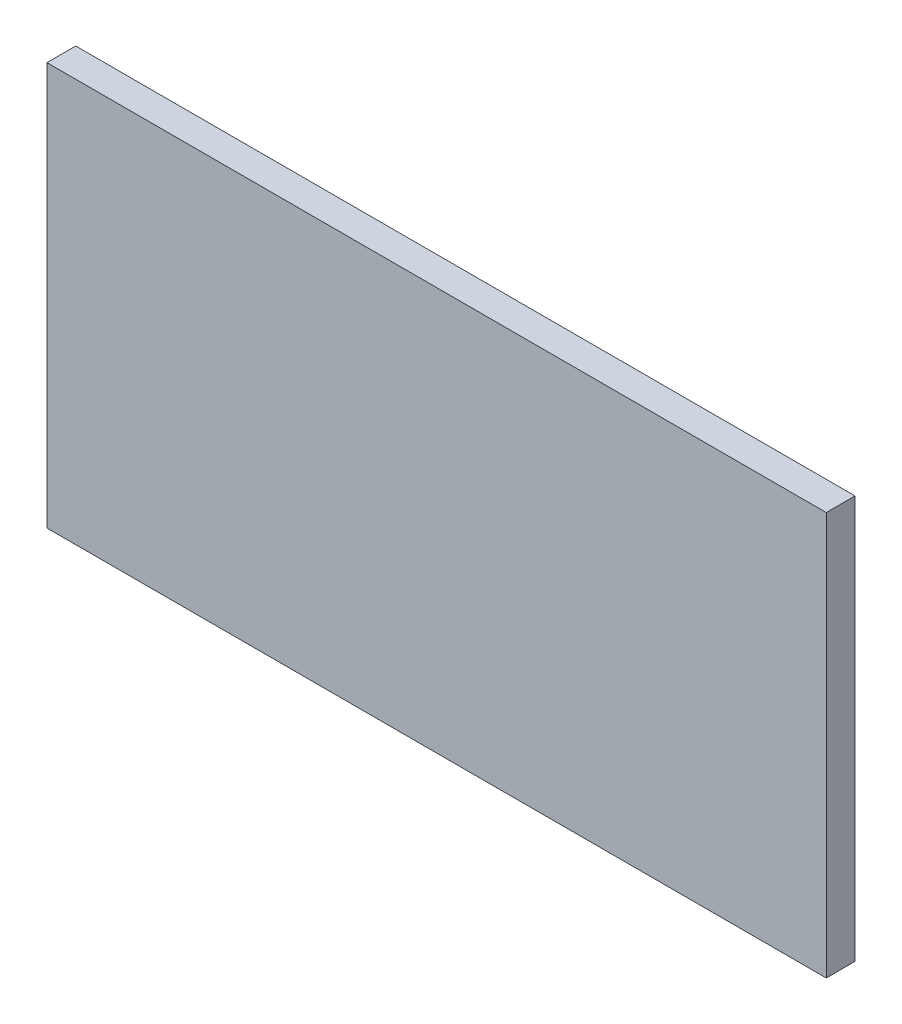
ISO-10303-21;
HEADER;
FILE_DESCRIPTION(('STEP AP214'),'2;1');
FILE_NAME('part.step','',(''),(''),'','','');
FILE_SCHEMA(('AUTOMOTIVE_DESIGN { 1 0 10303 214 1 1 1 1 }'));
ENDSEC;
DATA;
#1=APPLICATION_CONTEXT('core data for automotive mechanical design processes');
#2=APPLICATION_PROTOCOL_DEFINITION('international standard','automotive_design',2000,#1);
#3=PRODUCT_CONTEXT('',#1,'mechanical');
#4=PRODUCT('Part','Part','',(#3));
#5=PRODUCT_RELATED_PRODUCT_CATEGORY('part','',(#4));
#6=PRODUCT_DEFINITION_FORMATION('','',#4);
#7=PRODUCT_DEFINITION_CONTEXT('part definition',#1,'design');
#8=PRODUCT_DEFINITION('design','',#6,#7);
#9=PRODUCT_DEFINITION_SHAPE('','',#8);
#10=(LENGTH_UNIT() NAMED_UNIT(*) SI_UNIT(.MILLI.,.METRE.));
#11=(NAMED_UNIT(*) PLANE_ANGLE_UNIT() SI_UNIT($,.RADIAN.));
#12=(NAMED_UNIT(*) SI_UNIT($,.STERADIAN.) SOLID_ANGLE_UNIT());
#13=UNCERTAINTY_MEASURE_WITH_UNIT(LENGTH_MEASURE(1.E-05),#10,'distance_accuracy_value','');
#14=(GEOMETRIC_REPRESENTATION_CONTEXT(3) GLOBAL_UNCERTAINTY_ASSIGNED_CONTEXT((#13)) GLOBAL_UNIT_ASSIGNED_CONTEXT((#10,
#11,#12)) REPRESENTATION_CONTEXT('',''));
#15=CARTESIAN_POINT('',(0.,0.,0.));
#16=DIRECTION('',(0.,0.,1.));
#17=DIRECTION('',(1.,0.,0.));
#18=AXIS2_PLACEMENT_3D('',#15,#16,#17);
#19=CARTESIAN_POINT('',(0.,0.,0.));
#20=DIRECTION('',(0.,0.,-1.));
#21=DIRECTION('',(-1.,0.,0.));
#22=AXIS2_PLACEMENT_3D('',#19,#20,#21);
#23=PLANE('',#22);
#24=CARTESIAN_POINT('',(18.925,5.47,0.));
#25=DIRECTION('',(0.,0.,-1.));
#26=DIRECTION('',(-1.,0.,0.));
#27=AXIS2_PLACEMENT_3D('',#24,#25,#26);
#28=CIRCLE('',#27,0.650000000000001);
#29=CARTESIAN_POINT('',(18.275,5.47,0.));
#30=VERTEX_POINT('',#29);
#31=EDGE_CURVE('E230',#30,#30,#28,.T.);
#32=ORIENTED_EDGE('',*,*,#31,.F.);
#33=EDGE_LOOP('',(#32));
#34=FACE_BOUND('',#33,.T.);
#35=CARTESIAN_POINT('',(20.675,5.46999999999999,0.));
#36=DIRECTION('',(0.,0.,-1.));
#37=DIRECTION('',(-1.,0.,0.));
#38=AXIS2_PLACEMENT_3D('',#35,#36,#37);
#39=CIRCLE('',#38,0.650000000000001);
#40=CARTESIAN_POINT('',(20.025,5.46999999999999,0.));
#41=VERTEX_POINT('',#40);
#42=EDGE_CURVE('E218',#41,#41,#39,.T.);
#43=ORIENTED_EDGE('',*,*,#42,.F.);
#44=EDGE_LOOP('',(#43));
#45=FACE_BOUND('',#44,.T.);
#46=CARTESIAN_POINT('',(18.925,3.72,0.));
#47=DIRECTION('',(0.,0.,-1.));
#48=DIRECTION('',(-1.,0.,0.));
#49=AXIS2_PLACEMENT_3D('',#46,#47,#48);
#50=CIRCLE('',#49,0.650000000000001);
#51=CARTESIAN_POINT('',(18.275,3.72,0.));
#52=VERTEX_POINT('',#51);
#53=EDGE_CURVE('E206',#52,#52,#50,.T.);
#54=ORIENTED_EDGE('',*,*,#53,.F.);
#55=EDGE_LOOP('',(#54));
#56=FACE_BOUND('',#55,.T.);
#57=DIRECTION('',(0.,1.,0.));
#58=VECTOR('',#57,1.);
#59=CARTESIAN_POINT('',(0.,0.,0.));
#60=LINE('',#59,#58);
#61=CARTESIAN_POINT('',(0.,0.,0.));
#62=VERTEX_POINT('',#61);
#63=CARTESIAN_POINT('',(0.,21.,0.));
#64=VERTEX_POINT('',#63);
#65=EDGE_CURVE('E117',#62,#64,#60,.T.);
#66=ORIENTED_EDGE('',*,*,#65,.T.);
#67=DIRECTION('',(1.,0.,0.));
#68=VECTOR('',#67,1.);
#69=CARTESIAN_POINT('',(0.,21.,0.));
#70=LINE('',#69,#68);
#71=CARTESIAN_POINT('',(40.6,21.,0.));
#72=VERTEX_POINT('',#71);
#73=EDGE_CURVE('E156',#64,#72,#70,.T.);
#74=ORIENTED_EDGE('',*,*,#73,.T.);
#75=DIRECTION('',(0.,1.,0.));
#76=VECTOR('',#75,1.);
#77=CARTESIAN_POINT('',(40.6,0.,0.));
#78=LINE('',#77,#76);
#79=CARTESIAN_POINT('',(40.6,0.,0.));
#80=VERTEX_POINT('',#79);
#81=EDGE_CURVE('E159',#80,#72,#78,.T.);
#82=ORIENTED_EDGE('',*,*,#81,.F.);
#83=DIRECTION('',(1.,0.,0.));
#84=VECTOR('',#83,1.);
#85=CARTESIAN_POINT('',(0.,0.,0.));
#86=LINE('',#85,#84);
#87=EDGE_CURVE('E146',#62,#80,#86,.T.);
#88=ORIENTED_EDGE('',*,*,#87,.F.);
#89=EDGE_LOOP('',(#66,#74,#82,#88));
#90=FACE_BOUND('',#89,.T.);
#91=DIRECTION('',(1.,0.,0.));
#92=VECTOR('',#91,1.);
#93=CARTESIAN_POINT('',(6.5,14.81,0.));
#94=LINE('',#93,#92);
#95=CARTESIAN_POINT('',(6.5,14.81,0.));
#96=VERTEX_POINT('',#95);
#97=CARTESIAN_POINT('',(10.26,14.81,0.));
#98=VERTEX_POINT('',#97);
#99=EDGE_CURVE('E115',#96,#98,#94,.T.);
#100=ORIENTED_EDGE('',*,*,#99,.F.);
#101=DIRECTION('',(0.,1.,0.));
#102=VECTOR('',#101,1.);
#103=CARTESIAN_POINT('',(6.5,11.81,0.));
#104=LINE('',#103,#102);
#105=CARTESIAN_POINT('',(6.5,11.81,0.));
#106=VERTEX_POINT('',#105);
#107=EDGE_CURVE('E121',#106,#96,#104,.T.);
#108=ORIENTED_EDGE('',*,*,#107,.F.);
#109=DIRECTION('',(-1.,0.,0.));
#110=VECTOR('',#109,1.);
#111=CARTESIAN_POINT('',(6.5,11.81,0.));
#112=LINE('',#111,#110);
#113=CARTESIAN_POINT('',(10.26,11.81,0.));
#114=VERTEX_POINT('',#113);
#115=EDGE_CURVE('E133',#114,#106,#112,.T.);
#116=ORIENTED_EDGE('',*,*,#115,.F.);
#117=DIRECTION('',(0.,-1.,0.));
#118=VECTOR('',#117,1.);
#119=CARTESIAN_POINT('',(10.26,11.81,0.));
#120=LINE('',#119,#118);
#121=EDGE_CURVE('E131',#98,#114,#120,.T.);
#122=ORIENTED_EDGE('',*,*,#121,.F.);
#123=EDGE_LOOP('',(#100,#108,#116,#122));
#124=FACE_BOUND('',#123,.T.);
#125=CARTESIAN_POINT('',(20.675,3.71999999999999,0.));
#126=DIRECTION('',(0.,0.,-1.));
#127=DIRECTION('',(-1.,0.,0.));
#128=AXIS2_PLACEMENT_3D('',#125,#126,#127);
#129=CIRCLE('',#128,0.650000000000001);
#130=CARTESIAN_POINT('',(20.025,3.71999999999999,0.));
#131=VERTEX_POINT('',#130);
#132=EDGE_CURVE('E212',#131,#131,#129,.T.);
#133=ORIENTED_EDGE('',*,*,#132,.F.);
#134=EDGE_LOOP('',(#133));
#135=FACE_BOUND('',#134,.T.);
#136=CARTESIAN_POINT('',(20.675,7.21999999999999,0.));
#137=DIRECTION('',(0.,0.,-1.));
#138=DIRECTION('',(-1.,0.,0.));
#139=AXIS2_PLACEMENT_3D('',#136,#137,#138);
#140=CIRCLE('',#139,0.650000000000001);
#141=CARTESIAN_POINT('',(20.025,7.21999999999999,0.));
#142=VERTEX_POINT('',#141);
#143=EDGE_CURVE('E224',#142,#142,#140,.T.);
#144=ORIENTED_EDGE('',*,*,#143,.F.);
#145=EDGE_LOOP('',(#144));
#146=FACE_BOUND('',#145,.T.);
#147=CARTESIAN_POINT('',(18.925,7.22,0.));
#148=DIRECTION('',(0.,0.,-1.));
#149=DIRECTION('',(-1.,0.,0.));
#150=AXIS2_PLACEMENT_3D('',#147,#148,#149);
#151=CIRCLE('',#150,0.650000000000001);
#152=CARTESIAN_POINT('',(18.275,7.22,0.));
#153=VERTEX_POINT('',#152);
#154=EDGE_CURVE('E236',#153,#153,#151,.T.);
#155=ORIENTED_EDGE('',*,*,#154,.F.);
#156=EDGE_LOOP('',(#155));
#157=FACE_BOUND('',#156,.T.);
#158=ADVANCED_FACE('F35',(#34,#45,#56,#90,#124,#135,#146,#157),#23,.T.);
#159=CARTESIAN_POINT('',(0.,0.,1.5));
#160=DIRECTION('',(-1.,0.,0.));
#161=DIRECTION('',(0.,0.,1.));
#162=AXIS2_PLACEMENT_3D('',#159,#160,#161);
#163=PLANE('',#162);
#164=ORIENTED_EDGE('',*,*,#65,.F.);
#165=DIRECTION('',(0.,0.,-1.));
#166=VECTOR('',#165,1.);
#167=CARTESIAN_POINT('',(0.,0.,1.5));
#168=LINE('',#167,#166);
#169=CARTESIAN_POINT('',(0.,0.,1.5));
#170=VERTEX_POINT('',#169);
#171=EDGE_CURVE('E163',#170,#62,#168,.T.);
#172=ORIENTED_EDGE('',*,*,#171,.F.);
#173=DIRECTION('',(0.,1.,0.));
#174=VECTOR('',#173,1.);
#175=CARTESIAN_POINT('',(0.,0.,1.5));
#176=LINE('',#175,#174);
#177=CARTESIAN_POINT('',(0.,21.,1.5));
#178=VERTEX_POINT('',#177);
#179=EDGE_CURVE('E142',#170,#178,#176,.T.);
#180=ORIENTED_EDGE('',*,*,#179,.T.);
#181=DIRECTION('',(0.,0.,-1.));
#182=VECTOR('',#181,1.);
#183=CARTESIAN_POINT('',(0.,21.,1.5));
#184=LINE('',#183,#182);
#185=EDGE_CURVE('E153',#178,#64,#184,.T.);
#186=ORIENTED_EDGE('',*,*,#185,.T.);
#187=EDGE_LOOP('',(#164,#172,#180,#186));
#188=FACE_BOUND('',#187,.T.);
#189=ADVANCED_FACE('F252',(#188),#163,.T.);
#190=CARTESIAN_POINT('',(0.,0.,1.5));
#191=DIRECTION('',(0.,1.,0.));
#192=DIRECTION('',(0.,0.,1.));
#193=AXIS2_PLACEMENT_3D('',#190,#191,#192);
#194=PLANE('',#193);
#195=ORIENTED_EDGE('',*,*,#87,.T.);
#196=DIRECTION('',(0.,0.,-1.));
#197=VECTOR('',#196,1.);
#198=CARTESIAN_POINT('',(40.6,0.,1.5));
#199=LINE('',#198,#197);
#200=CARTESIAN_POINT('',(40.6,0.,1.5));
#201=VERTEX_POINT('',#200);
#202=EDGE_CURVE('E166',#201,#80,#199,.T.);
#203=ORIENTED_EDGE('',*,*,#202,.F.);
#204=DIRECTION('',(1.,0.,0.));
#205=VECTOR('',#204,1.);
#206=CARTESIAN_POINT('',(0.,0.,1.5));
#207=LINE('',#206,#205);
#208=EDGE_CURVE('E151',#170,#201,#207,.T.);
#209=ORIENTED_EDGE('',*,*,#208,.F.);
#210=ORIENTED_EDGE('',*,*,#171,.T.);
#211=EDGE_LOOP('',(#195,#203,#209,#210));
#212=FACE_BOUND('',#211,.T.);
#213=ADVANCED_FACE('F258',(#212),#194,.F.);
#214=CARTESIAN_POINT('',(40.6,0.,1.5));
#215=DIRECTION('',(-1.,0.,0.));
#216=DIRECTION('',(0.,0.,1.));
#217=AXIS2_PLACEMENT_3D('',#214,#215,#216);
#218=PLANE('',#217);
#219=ORIENTED_EDGE('',*,*,#81,.T.);
#220=DIRECTION('',(0.,0.,-1.));
#221=VECTOR('',#220,1.);
#222=CARTESIAN_POINT('',(40.6,21.,1.5));
#223=LINE('',#222,#221);
#224=CARTESIAN_POINT('',(40.6,21.,1.5));
#225=VERTEX_POINT('',#224);
#226=EDGE_CURVE('E169',#225,#72,#223,.T.);
#227=ORIENTED_EDGE('',*,*,#226,.F.);
#228=DIRECTION('',(0.,1.,0.));
#229=VECTOR('',#228,1.);
#230=CARTESIAN_POINT('',(40.6,0.,1.5));
#231=LINE('',#230,#229);
#232=EDGE_CURVE('E149',#201,#225,#231,.T.);
#233=ORIENTED_EDGE('',*,*,#232,.F.);
#234=ORIENTED_EDGE('',*,*,#202,.T.);
#235=EDGE_LOOP('',(#219,#227,#233,#234));
#236=FACE_BOUND('',#235,.T.);
#237=ADVANCED_FACE('F269',(#236),#218,.F.);
#238=CARTESIAN_POINT('',(0.,21.,1.5));
#239=DIRECTION('',(0.,1.,0.));
#240=DIRECTION('',(0.,0.,1.));
#241=AXIS2_PLACEMENT_3D('',#238,#239,#240);
#242=PLANE('',#241);
#243=ORIENTED_EDGE('',*,*,#73,.F.);
#244=ORIENTED_EDGE('',*,*,#185,.F.);
#245=DIRECTION('',(1.,0.,0.));
#246=VECTOR('',#245,1.);
#247=CARTESIAN_POINT('',(0.,21.,1.5));
#248=LINE('',#247,#246);
#249=EDGE_CURVE('E145',#178,#225,#248,.T.);
#250=ORIENTED_EDGE('',*,*,#249,.T.);
#251=ORIENTED_EDGE('',*,*,#226,.T.);
#252=EDGE_LOOP('',(#243,#244,#250,#251));
#253=FACE_BOUND('',#252,.T.);
#254=ADVANCED_FACE('F273',(#253),#242,.T.);
#255=CARTESIAN_POINT('',(0.,0.,1.5));
#256=DIRECTION('',(0.,0.,-1.));
#257=DIRECTION('',(-1.,0.,0.));
#258=AXIS2_PLACEMENT_3D('',#255,#256,#257);
#259=PLANE('',#258);
#260=ORIENTED_EDGE('',*,*,#179,.F.);
#261=ORIENTED_EDGE('',*,*,#208,.T.);
#262=ORIENTED_EDGE('',*,*,#232,.T.);
#263=ORIENTED_EDGE('',*,*,#249,.F.);
#264=EDGE_LOOP('',(#260,#261,#262,#263));
#265=FACE_BOUND('',#264,.T.);
#266=ADVANCED_FACE('F265',(#265),#259,.F.);
#267=CARTESIAN_POINT('',(6.5,11.81,-1.1));
#268=DIRECTION('',(1.,0.,0.));
#269=DIRECTION('',(0.,0.,-1.));
#270=AXIS2_PLACEMENT_3D('',#267,#268,#269);
#271=PLANE('',#270);
#272=DIRECTION('',(0.,0.,1.));
#273=VECTOR('',#272,1.);
#274=CARTESIAN_POINT('',(6.5,14.81,-1.1));
#275=LINE('',#274,#273);
#276=CARTESIAN_POINT('',(6.5,14.81,-0.6));
#277=VERTEX_POINT('',#276);
#278=EDGE_CURVE('E111',#277,#96,#275,.T.);
#279=ORIENTED_EDGE('',*,*,#278,.F.);
#280=DIRECTION('',(0.,1.,0.));
#281=VECTOR('',#280,1.);
#282=CARTESIAN_POINT('',(6.5,11.81,-0.6));
#283=LINE('',#282,#281);
#284=CARTESIAN_POINT('',(6.5,11.81,-0.6));
#285=VERTEX_POINT('',#284);
#286=EDGE_CURVE('E44',#277,#285,#283,.F.);
#287=ORIENTED_EDGE('',*,*,#286,.T.);
#288=DIRECTION('',(0.,0.,1.));
#289=VECTOR('',#288,1.);
#290=CARTESIAN_POINT('',(6.5,11.81,-1.1));
#291=LINE('',#290,#289);
#292=EDGE_CURVE('E123',#285,#106,#291,.T.);
#293=ORIENTED_EDGE('',*,*,#292,.T.);
#294=ORIENTED_EDGE('',*,*,#107,.T.);
#295=EDGE_LOOP('',(#279,#287,#293,#294));
#296=FACE_BOUND('',#295,.T.);
#297=ADVANCED_FACE('F122',(#296),#271,.F.);
#298=CARTESIAN_POINT('',(6.5,14.81,-1.1));
#299=DIRECTION('',(0.,-1.,0.));
#300=DIRECTION('',(1.,0.,0.));
#301=AXIS2_PLACEMENT_3D('',#298,#299,#300);
#302=PLANE('',#301);
#303=DIRECTION('',(0.,0.,1.));
#304=VECTOR('',#303,1.);
#305=CARTESIAN_POINT('',(10.26,14.81,-1.1));
#306=LINE('',#305,#304);
#307=CARTESIAN_POINT('',(10.26,14.81,-0.6));
#308=VERTEX_POINT('',#307);
#309=EDGE_CURVE('E118',#308,#98,#306,.T.);
#310=ORIENTED_EDGE('',*,*,#309,.F.);
#311=DIRECTION('',(1.,0.,0.));
#312=VECTOR('',#311,1.);
#313=CARTESIAN_POINT('',(6.5,14.81,-0.6));
#314=LINE('',#313,#312);
#315=EDGE_CURVE('E59',#308,#277,#314,.F.);
#316=ORIENTED_EDGE('',*,*,#315,.T.);
#317=ORIENTED_EDGE('',*,*,#278,.T.);
#318=ORIENTED_EDGE('',*,*,#99,.T.);
#319=EDGE_LOOP('',(#310,#316,#317,#318));
#320=FACE_BOUND('',#319,.T.);
#321=ADVANCED_FACE('F113',(#320),#302,.F.);
#322=CARTESIAN_POINT('',(10.26,11.81,-1.1));
#323=DIRECTION('',(-1.,0.,0.));
#324=DIRECTION('',(0.,-1.,0.));
#325=AXIS2_PLACEMENT_3D('',#322,#323,#324);
#326=PLANE('',#325);
#327=DIRECTION('',(0.,0.,1.));
#328=VECTOR('',#327,1.);
#329=CARTESIAN_POINT('',(10.26,11.81,-1.1));
#330=LINE('',#329,#328);
#331=CARTESIAN_POINT('',(10.26,11.81,-0.6));
#332=VERTEX_POINT('',#331);
#333=EDGE_CURVE('E139',#332,#114,#330,.T.);
#334=ORIENTED_EDGE('',*,*,#333,.F.);
#335=DIRECTION('',(0.,-1.,0.));
#336=VECTOR('',#335,1.);
#337=CARTESIAN_POINT('',(10.26,14.81,-0.6));
#338=LINE('',#337,#336);
#339=EDGE_CURVE('E180',#332,#308,#338,.F.);
#340=ORIENTED_EDGE('',*,*,#339,.T.);
#341=ORIENTED_EDGE('',*,*,#309,.T.);
#342=ORIENTED_EDGE('',*,*,#121,.T.);
#343=EDGE_LOOP('',(#334,#340,#341,#342));
#344=FACE_BOUND('',#343,.T.);
#345=ADVANCED_FACE('F305',(#344),#326,.F.);
#346=CARTESIAN_POINT('',(6.5,11.81,-1.1));
#347=DIRECTION('',(0.,1.,0.));
#348=DIRECTION('',(-1.,0.,0.));
#349=AXIS2_PLACEMENT_3D('',#346,#347,#348);
#350=PLANE('',#349);
#351=ORIENTED_EDGE('',*,*,#292,.F.);
#352=DIRECTION('',(-1.,0.,0.));
#353=VECTOR('',#352,1.);
#354=CARTESIAN_POINT('',(10.26,11.81,-0.6));
#355=LINE('',#354,#353);
#356=EDGE_CURVE('E11',#285,#332,#355,.F.);
#357=ORIENTED_EDGE('',*,*,#356,.T.);
#358=ORIENTED_EDGE('',*,*,#333,.T.);
#359=ORIENTED_EDGE('',*,*,#115,.T.);
#360=EDGE_LOOP('',(#351,#357,#358,#359));
#361=FACE_BOUND('',#360,.T.);
#362=ADVANCED_FACE('F302',(#361),#350,.F.);
#363=CARTESIAN_POINT('',(0.,0.,-1.1));
#364=DIRECTION('',(0.,0.,-1.));
#365=DIRECTION('',(-1.,0.,0.));
#366=AXIS2_PLACEMENT_3D('',#363,#364,#365);
#367=PLANE('',#366);
#368=DIRECTION('',(1.,0.,0.));
#369=VECTOR('',#368,1.);
#370=CARTESIAN_POINT('',(10.26,14.31,-1.1));
#371=LINE('',#370,#369);
#372=CARTESIAN_POINT('',(7.,14.31,-1.1));
#373=VERTEX_POINT('',#372);
#374=CARTESIAN_POINT('',(9.76,14.31,-1.1));
#375=VERTEX_POINT('',#374);
#376=EDGE_CURVE('E175',#373,#375,#371,.T.);
#377=ORIENTED_EDGE('',*,*,#376,.T.);
#378=DIRECTION('',(0.,-1.,0.));
#379=VECTOR('',#378,1.);
#380=CARTESIAN_POINT('',(9.76,11.81,-1.1));
#381=LINE('',#380,#379);
#382=CARTESIAN_POINT('',(9.76,12.31,-1.1));
#383=VERTEX_POINT('',#382);
#384=EDGE_CURVE('E177',#375,#383,#381,.T.);
#385=ORIENTED_EDGE('',*,*,#384,.T.);
#386=DIRECTION('',(-1.,0.,0.));
#387=VECTOR('',#386,1.);
#388=CARTESIAN_POINT('',(6.5,12.31,-1.1));
#389=LINE('',#388,#387);
#390=CARTESIAN_POINT('',(7.,12.31,-1.1));
#391=VERTEX_POINT('',#390);
#392=EDGE_CURVE('E165',#383,#391,#389,.T.);
#393=ORIENTED_EDGE('',*,*,#392,.T.);
#394=DIRECTION('',(0.,1.,0.));
#395=VECTOR('',#394,1.);
#396=CARTESIAN_POINT('',(7.,14.81,-1.1));
#397=LINE('',#396,#395);
#398=EDGE_CURVE('E173',#391,#373,#397,.T.);
#399=ORIENTED_EDGE('',*,*,#398,.T.);
#400=EDGE_LOOP('',(#377,#385,#393,#399));
#401=FACE_BOUND('',#400,.T.);
#402=CARTESIAN_POINT('',(9.08,13.31,-1.1));
#403=DIRECTION('',(0.,0.,-1.));
#404=DIRECTION('',(-1.,0.,0.));
#405=AXIS2_PLACEMENT_3D('',#402,#403,#404);
#406=CIRCLE('',#405,0.25);
#407=CARTESIAN_POINT('',(8.83,13.31,-1.1));
#408=VERTEX_POINT('',#407);
#409=EDGE_CURVE('E196',#408,#408,#406,.T.);
#410=ORIENTED_EDGE('',*,*,#409,.F.);
#411=EDGE_LOOP('',(#410));
#412=FACE_BOUND('',#411,.T.);
#413=ADVANCED_FACE('F309',(#401,#412),#367,.T.);
#414=CARTESIAN_POINT('',(9.08,13.31,-0.6));
#415=DIRECTION('',(0.,0.,-1.));
#416=DIRECTION('',(-1.,0.,0.));
#417=AXIS2_PLACEMENT_3D('',#414,#415,#416);
#418=CYLINDRICAL_SURFACE('',#417,0.25);
#419=CARTESIAN_POINT('',(9.08,13.31,-0.6));
#420=DIRECTION('',(0.,0.,-1.));
#421=DIRECTION('',(-1.,0.,0.));
#422=AXIS2_PLACEMENT_3D('',#419,#420,#421);
#423=CIRCLE('',#422,0.25);
#424=CARTESIAN_POINT('',(8.83,13.31,-0.6));
#425=VERTEX_POINT('',#424);
#426=EDGE_CURVE('E127',#425,#425,#423,.T.);
#427=ORIENTED_EDGE('',*,*,#426,.F.);
#428=EDGE_LOOP('',(#427));
#429=FACE_BOUND('',#428,.T.);
#430=ORIENTED_EDGE('',*,*,#409,.T.);
#431=EDGE_LOOP('',(#430));
#432=FACE_BOUND('',#431,.T.);
#433=ADVANCED_FACE('F295',(#429,#432),#418,.F.);
#434=CARTESIAN_POINT('',(9.08,13.31,-0.6));
#435=DIRECTION('',(0.,0.,-1.));
#436=DIRECTION('',(-1.,0.,0.));
#437=AXIS2_PLACEMENT_3D('',#434,#435,#436);
#438=PLANE('',#437);
#439=ORIENTED_EDGE('',*,*,#426,.T.);
#440=EDGE_LOOP('',(#439));
#441=FACE_BOUND('',#440,.T.);
#442=ADVANCED_FACE('F290',(#441),#438,.T.);
#443=CARTESIAN_POINT('',(7.,0.,-0.6));
#444=DIRECTION('',(0.,-1.,0.));
#445=DIRECTION('',(0.,0.,-1.));
#446=AXIS2_PLACEMENT_3D('',#443,#444,#445);
#447=CYLINDRICAL_SURFACE('',#446,0.5);
#448=CARTESIAN_POINT('',(7.,12.31,-0.6));
#449=DIRECTION('',(0.707106781186547,-0.707106781186548,0.));
#450=DIRECTION('',(0.707106781186548,0.707106781186547,0.));
#451=AXIS2_PLACEMENT_3D('',#448,#449,#450);
#452=ELLIPSE('',#451,0.707106781186547,0.5);
#453=EDGE_CURVE('E189',#285,#391,#452,.T.);
#454=ORIENTED_EDGE('',*,*,#453,.F.);
#455=ORIENTED_EDGE('',*,*,#286,.F.);
#456=CARTESIAN_POINT('',(7.,14.31,-0.6));
#457=DIRECTION('',(-0.707106781186548,-0.707106781186547,0.));
#458=DIRECTION('',(0.707106781186547,-0.707106781186548,0.));
#459=AXIS2_PLACEMENT_3D('',#456,#457,#458);
#460=ELLIPSE('',#459,0.707106781186548,0.5);
#461=EDGE_CURVE('E39',#373,#277,#460,.F.);
#462=ORIENTED_EDGE('',*,*,#461,.F.);
#463=ORIENTED_EDGE('',*,*,#398,.F.);
#464=EDGE_LOOP('',(#454,#455,#462,#463));
#465=FACE_BOUND('',#464,.T.);
#466=ADVANCED_FACE('F37',(#465),#447,.T.);
#467=CARTESIAN_POINT('',(0.,14.31,-0.6));
#468=DIRECTION('',(-1.,0.,0.));
#469=DIRECTION('',(0.,-1.,0.));
#470=AXIS2_PLACEMENT_3D('',#467,#468,#469);
#471=CYLINDRICAL_SURFACE('',#470,0.5);
#472=ORIENTED_EDGE('',*,*,#461,.T.);
#473=ORIENTED_EDGE('',*,*,#315,.F.);
#474=CARTESIAN_POINT('',(9.76,14.31,-0.6));
#475=DIRECTION('',(-0.707106781186547,0.707106781186548,0.));
#476=DIRECTION('',(-0.707106781186548,-0.707106781186547,0.));
#477=AXIS2_PLACEMENT_3D('',#474,#475,#476);
#478=ELLIPSE('',#477,0.707106781186548,0.5);
#479=EDGE_CURVE('E187',#375,#308,#478,.F.);
#480=ORIENTED_EDGE('',*,*,#479,.F.);
#481=ORIENTED_EDGE('',*,*,#376,.F.);
#482=EDGE_LOOP('',(#472,#473,#480,#481));
#483=FACE_BOUND('',#482,.T.);
#484=ADVANCED_FACE('F285',(#483),#471,.T.);
#485=CARTESIAN_POINT('',(0.,12.31,-0.6));
#486=DIRECTION('',(1.,0.,0.));
#487=DIRECTION('',(0.,1.,0.));
#488=AXIS2_PLACEMENT_3D('',#485,#486,#487);
#489=CYLINDRICAL_SURFACE('',#488,0.5);
#490=ORIENTED_EDGE('',*,*,#453,.T.);
#491=ORIENTED_EDGE('',*,*,#392,.F.);
#492=CARTESIAN_POINT('',(9.76,12.31,-0.6));
#493=DIRECTION('',(0.707106781186548,0.707106781186547,0.));
#494=DIRECTION('',(0.707106781186547,-0.707106781186548,0.));
#495=AXIS2_PLACEMENT_3D('',#492,#493,#494);
#496=ELLIPSE('',#495,0.707106781186547,0.5);
#497=EDGE_CURVE('E185',#332,#383,#496,.T.);
#498=ORIENTED_EDGE('',*,*,#497,.F.);
#499=ORIENTED_EDGE('',*,*,#356,.F.);
#500=EDGE_LOOP('',(#490,#491,#498,#499));
#501=FACE_BOUND('',#500,.T.);
#502=ADVANCED_FACE('F282',(#501),#489,.T.);
#503=CARTESIAN_POINT('',(9.75999999999999,0.,-0.6));
#504=DIRECTION('',(0.,1.,0.));
#505=DIRECTION('',(-1.,0.,0.));
#506=AXIS2_PLACEMENT_3D('',#503,#504,#505);
#507=CYLINDRICAL_SURFACE('',#506,0.5);
#508=ORIENTED_EDGE('',*,*,#479,.T.);
#509=ORIENTED_EDGE('',*,*,#339,.F.);
#510=ORIENTED_EDGE('',*,*,#497,.T.);
#511=ORIENTED_EDGE('',*,*,#384,.F.);
#512=EDGE_LOOP('',(#508,#509,#510,#511));
#513=FACE_BOUND('',#512,.T.);
#514=ADVANCED_FACE('F278',(#513),#507,.T.);
#515=CARTESIAN_POINT('',(18.925,3.72,-0.25));
#516=DIRECTION('',(0.,0.,1.));
#517=DIRECTION('',(1.,0.,0.));
#518=AXIS2_PLACEMENT_3D('',#515,#516,#517);
#519=CYLINDRICAL_SURFACE('',#518,0.650000000000001);
#520=CARTESIAN_POINT('',(18.925,3.72,-0.25));
#521=DIRECTION('',(0.,0.,-1.));
#522=DIRECTION('',(-1.,0.,0.));
#523=AXIS2_PLACEMENT_3D('',#520,#521,#522);
#524=CIRCLE('',#523,0.650000000000001);
#525=CARTESIAN_POINT('',(18.275,3.72,-0.25));
#526=VERTEX_POINT('',#525);
#527=EDGE_CURVE('E188',#526,#526,#524,.T.);
#528=ORIENTED_EDGE('',*,*,#527,.F.);
#529=EDGE_LOOP('',(#528));
#530=FACE_BOUND('',#529,.T.);
#531=ORIENTED_EDGE('',*,*,#53,.T.);
#532=EDGE_LOOP('',(#531));
#533=FACE_BOUND('',#532,.T.);
#534=ADVANCED_FACE('F281',(#530,#533),#519,.T.);
#535=CARTESIAN_POINT('',(18.925,3.72,-0.25));
#536=DIRECTION('',(0.,0.,-1.));
#537=DIRECTION('',(-1.,0.,0.));
#538=AXIS2_PLACEMENT_3D('',#535,#536,#537);
#539=PLANE('',#538);
#540=ORIENTED_EDGE('',*,*,#527,.T.);
#541=EDGE_LOOP('',(#540));
#542=FACE_BOUND('',#541,.T.);
#543=ADVANCED_FACE('F431',(#542),#539,.T.);
#544=CARTESIAN_POINT('',(20.675,3.71999999999999,-0.25));
#545=DIRECTION('',(0.,0.,1.));
#546=DIRECTION('',(1.,0.,0.));
#547=AXIS2_PLACEMENT_3D('',#544,#545,#546);
#548=CYLINDRICAL_SURFACE('',#547,0.650000000000001);
#549=CARTESIAN_POINT('',(20.675,3.71999999999999,-0.25));
#550=DIRECTION('',(0.,0.,-1.));
#551=DIRECTION('',(-1.,0.,0.));
#552=AXIS2_PLACEMENT_3D('',#549,#550,#551);
#553=CIRCLE('',#552,0.650000000000001);
#554=CARTESIAN_POINT('',(20.025,3.71999999999999,-0.25));
#555=VERTEX_POINT('',#554);
#556=EDGE_CURVE('E209',#555,#555,#553,.T.);
#557=ORIENTED_EDGE('',*,*,#556,.F.);
#558=EDGE_LOOP('',(#557));
#559=FACE_BOUND('',#558,.T.);
#560=ORIENTED_EDGE('',*,*,#132,.T.);
#561=EDGE_LOOP('',(#560));
#562=FACE_BOUND('',#561,.T.);
#563=ADVANCED_FACE('F440',(#559,#562),#548,.T.);
#564=CARTESIAN_POINT('',(20.675,3.71999999999999,-0.25));
#565=DIRECTION('',(0.,0.,-1.));
#566=DIRECTION('',(-1.,0.,0.));
#567=AXIS2_PLACEMENT_3D('',#564,#565,#566);
#568=PLANE('',#567);
#569=ORIENTED_EDGE('',*,*,#556,.T.);
#570=EDGE_LOOP('',(#569));
#571=FACE_BOUND('',#570,.T.);
#572=ADVANCED_FACE('F449',(#571),#568,.T.);
#573=CARTESIAN_POINT('',(20.675,5.46999999999999,-0.25));
#574=DIRECTION('',(0.,0.,1.));
#575=DIRECTION('',(1.,0.,0.));
#576=AXIS2_PLACEMENT_3D('',#573,#574,#575);
#577=CYLINDRICAL_SURFACE('',#576,0.650000000000001);
#578=CARTESIAN_POINT('',(20.675,5.46999999999999,-0.25));
#579=DIRECTION('',(0.,0.,-1.));
#580=DIRECTION('',(-1.,0.,0.));
#581=AXIS2_PLACEMENT_3D('',#578,#579,#580);
#582=CIRCLE('',#581,0.650000000000001);
#583=CARTESIAN_POINT('',(20.025,5.46999999999999,-0.25));
#584=VERTEX_POINT('',#583);
#585=EDGE_CURVE('E215',#584,#584,#582,.T.);
#586=ORIENTED_EDGE('',*,*,#585,.F.);
#587=EDGE_LOOP('',(#586));
#588=FACE_BOUND('',#587,.T.);
#589=ORIENTED_EDGE('',*,*,#42,.T.);
#590=EDGE_LOOP('',(#589));
#591=FACE_BOUND('',#590,.T.);
#592=ADVANCED_FACE('F458',(#588,#591),#577,.T.);
#593=CARTESIAN_POINT('',(20.675,5.46999999999999,-0.25));
#594=DIRECTION('',(0.,0.,-1.));
#595=DIRECTION('',(-1.,0.,0.));
#596=AXIS2_PLACEMENT_3D('',#593,#594,#595);
#597=PLANE('',#596);
#598=ORIENTED_EDGE('',*,*,#585,.T.);
#599=EDGE_LOOP('',(#598));
#600=FACE_BOUND('',#599,.T.);
#601=ADVANCED_FACE('F467',(#600),#597,.T.);
#602=CARTESIAN_POINT('',(20.675,7.21999999999999,-0.25));
#603=DIRECTION('',(0.,0.,1.));
#604=DIRECTION('',(1.,0.,0.));
#605=AXIS2_PLACEMENT_3D('',#602,#603,#604);
#606=CYLINDRICAL_SURFACE('',#605,0.650000000000001);
#607=CARTESIAN_POINT('',(20.675,7.21999999999999,-0.25));
#608=DIRECTION('',(0.,0.,-1.));
#609=DIRECTION('',(-1.,0.,0.));
#610=AXIS2_PLACEMENT_3D('',#607,#608,#609);
#611=CIRCLE('',#610,0.650000000000001);
#612=CARTESIAN_POINT('',(20.025,7.21999999999999,-0.25));
#613=VERTEX_POINT('',#612);
#614=EDGE_CURVE('E221',#613,#613,#611,.T.);
#615=ORIENTED_EDGE('',*,*,#614,.F.);
#616=EDGE_LOOP('',(#615));
#617=FACE_BOUND('',#616,.T.);
#618=ORIENTED_EDGE('',*,*,#143,.T.);
#619=EDGE_LOOP('',(#618));
#620=FACE_BOUND('',#619,.T.);
#621=ADVANCED_FACE('F476',(#617,#620),#606,.T.);
#622=CARTESIAN_POINT('',(20.675,7.21999999999999,-0.25));
#623=DIRECTION('',(0.,0.,-1.));
#624=DIRECTION('',(-1.,0.,0.));
#625=AXIS2_PLACEMENT_3D('',#622,#623,#624);
#626=PLANE('',#625);
#627=ORIENTED_EDGE('',*,*,#614,.T.);
#628=EDGE_LOOP('',(#627));
#629=FACE_BOUND('',#628,.T.);
#630=ADVANCED_FACE('F485',(#629),#626,.T.);
#631=CARTESIAN_POINT('',(18.925,5.47,-0.25));
#632=DIRECTION('',(0.,0.,1.));
#633=DIRECTION('',(1.,0.,0.));
#634=AXIS2_PLACEMENT_3D('',#631,#632,#633);
#635=CYLINDRICAL_SURFACE('',#634,0.650000000000001);
#636=CARTESIAN_POINT('',(18.925,5.47,-0.25));
#637=DIRECTION('',(0.,0.,-1.));
#638=DIRECTION('',(-1.,0.,0.));
#639=AXIS2_PLACEMENT_3D('',#636,#637,#638);
#640=CIRCLE('',#639,0.650000000000001);
#641=CARTESIAN_POINT('',(18.275,5.47,-0.25));
#642=VERTEX_POINT('',#641);
#643=EDGE_CURVE('E227',#642,#642,#640,.T.);
#644=ORIENTED_EDGE('',*,*,#643,.F.);
#645=EDGE_LOOP('',(#644));
#646=FACE_BOUND('',#645,.T.);
#647=ORIENTED_EDGE('',*,*,#31,.T.);
#648=EDGE_LOOP('',(#647));
#649=FACE_BOUND('',#648,.T.);
#650=ADVANCED_FACE('F494',(#646,#649),#635,.T.);
#651=CARTESIAN_POINT('',(18.925,5.47,-0.25));
#652=DIRECTION('',(0.,0.,-1.));
#653=DIRECTION('',(-1.,0.,0.));
#654=AXIS2_PLACEMENT_3D('',#651,#652,#653);
#655=PLANE('',#654);
#656=ORIENTED_EDGE('',*,*,#643,.T.);
#657=EDGE_LOOP('',(#656));
#658=FACE_BOUND('',#657,.T.);
#659=ADVANCED_FACE('F247',(#658),#655,.T.);
#660=CARTESIAN_POINT('',(18.925,7.22,-0.25));
#661=DIRECTION('',(0.,0.,1.));
#662=DIRECTION('',(1.,0.,0.));
#663=AXIS2_PLACEMENT_3D('',#660,#661,#662);
#664=CYLINDRICAL_SURFACE('',#663,0.650000000000001);
#665=CARTESIAN_POINT('',(18.925,7.22,-0.25));
#666=DIRECTION('',(0.,0.,-1.));
#667=DIRECTION('',(-1.,0.,0.));
#668=AXIS2_PLACEMENT_3D('',#665,#666,#667);
#669=CIRCLE('',#668,0.650000000000001);
#670=CARTESIAN_POINT('',(18.275,7.22,-0.25));
#671=VERTEX_POINT('',#670);
#672=EDGE_CURVE('E233',#671,#671,#669,.T.);
#673=ORIENTED_EDGE('',*,*,#672,.F.);
#674=EDGE_LOOP('',(#673));
#675=FACE_BOUND('',#674,.T.);
#676=ORIENTED_EDGE('',*,*,#154,.T.);
#677=EDGE_LOOP('',(#676));
#678=FACE_BOUND('',#677,.T.);
#679=ADVANCED_FACE('F244',(#675,#678),#664,.T.);
#680=CARTESIAN_POINT('',(18.925,7.22,-0.25));
#681=DIRECTION('',(0.,0.,-1.));
#682=DIRECTION('',(-1.,0.,0.));
#683=AXIS2_PLACEMENT_3D('',#680,#681,#682);
#684=PLANE('',#683);
#685=ORIENTED_EDGE('',*,*,#672,.T.);
#686=EDGE_LOOP('',(#685));
#687=FACE_BOUND('',#686,.T.);
#688=ADVANCED_FACE('F242',(#687),#684,.T.);
#689=CLOSED_SHELL('',(#158,#189,#213,#237,#254,#266,#297,#321,#345,#362,#413,#433,#442,#466,
#484,#502,#514,#534,#543,#563,#572,#592,#601,#621,#630,#650,#659,#679,#688));
#690=MANIFOLD_SOLID_BREP('B2',#689);
#691=ADVANCED_BREP_SHAPE_REPRESENTATION('',(#18,#690),#14);
#692=SHAPE_DEFINITION_REPRESENTATION(#9,#691);
ENDSEC;
END-ISO-10303-21;
